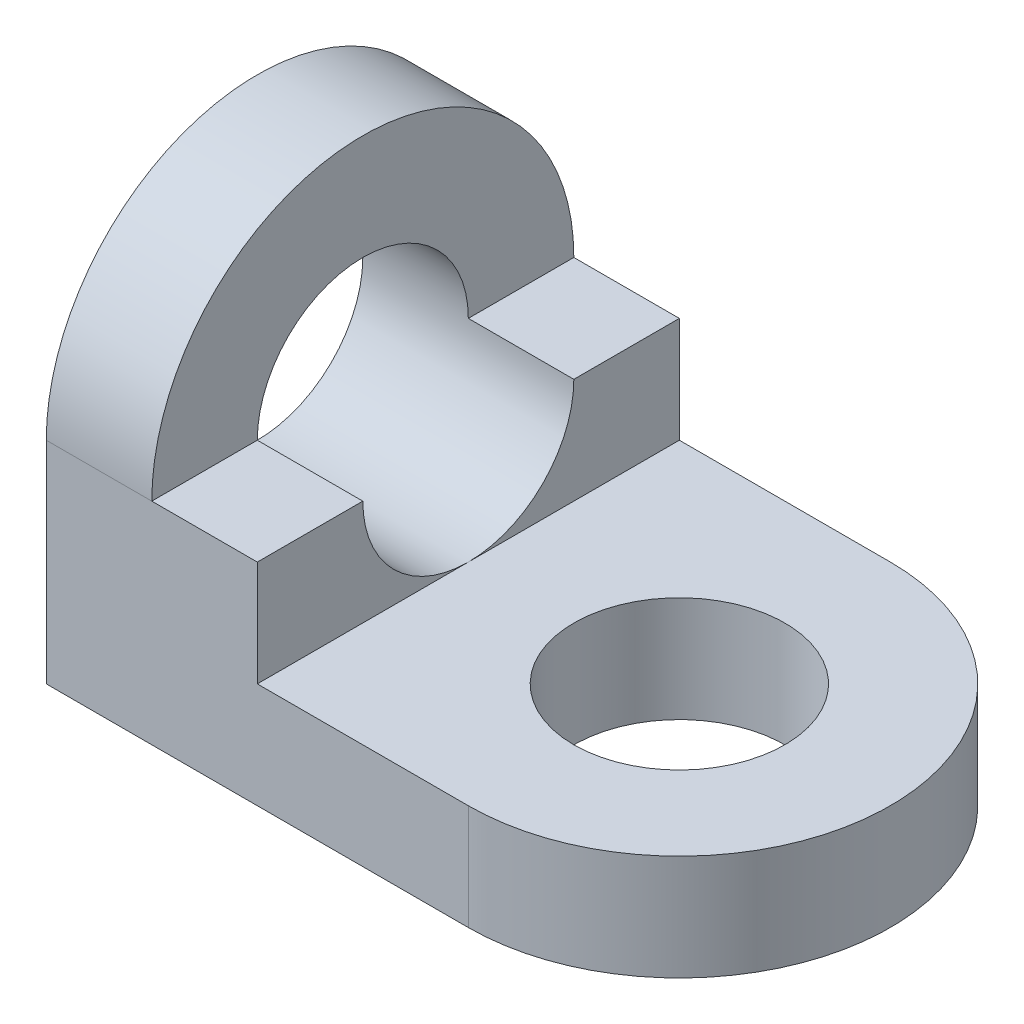
ISO-10303-21;
HEADER;
FILE_DESCRIPTION(('STEP AP214'),'2;1');
FILE_NAME('part.step','',(''),(''),'','','');
FILE_SCHEMA(('AUTOMOTIVE_DESIGN { 1 0 10303 214 1 1 1 1 }'));
ENDSEC;
DATA;
#1=APPLICATION_CONTEXT('core data for automotive mechanical design processes');
#2=APPLICATION_PROTOCOL_DEFINITION('international standard','automotive_design',2000,#1);
#3=PRODUCT_CONTEXT('',#1,'mechanical');
#4=PRODUCT('Part','Part','',(#3));
#5=PRODUCT_RELATED_PRODUCT_CATEGORY('part','',(#4));
#6=PRODUCT_DEFINITION_FORMATION('','',#4);
#7=PRODUCT_DEFINITION_CONTEXT('part definition',#1,'design');
#8=PRODUCT_DEFINITION('design','',#6,#7);
#9=PRODUCT_DEFINITION_SHAPE('','',#8);
#10=(LENGTH_UNIT() NAMED_UNIT(*) SI_UNIT(.MILLI.,.METRE.));
#11=(NAMED_UNIT(*) PLANE_ANGLE_UNIT() SI_UNIT($,.RADIAN.));
#12=(NAMED_UNIT(*) SI_UNIT($,.STERADIAN.) SOLID_ANGLE_UNIT());
#13=UNCERTAINTY_MEASURE_WITH_UNIT(LENGTH_MEASURE(1.E-05),#10,'distance_accuracy_value','');
#14=(GEOMETRIC_REPRESENTATION_CONTEXT(3) GLOBAL_UNCERTAINTY_ASSIGNED_CONTEXT((#13)) GLOBAL_UNIT_ASSIGNED_CONTEXT((#10,
#11,#12)) REPRESENTATION_CONTEXT('',''));
#15=CARTESIAN_POINT('',(0.,0.,0.));
#16=DIRECTION('',(0.,0.,1.));
#17=DIRECTION('',(1.,0.,0.));
#18=AXIS2_PLACEMENT_3D('',#15,#16,#17);
#19=CARTESIAN_POINT('',(5.,0.,0.));
#20=DIRECTION('',(1.,0.,0.));
#21=DIRECTION('',(0.,0.,-1.));
#22=AXIS2_PLACEMENT_3D('',#19,#20,#21);
#23=PLANE('',#22);
#24=DIRECTION('',(0.,0.,1.));
#25=VECTOR('',#24,1.);
#26=CARTESIAN_POINT('',(5.,10.,0.));
#27=LINE('',#26,#25);
#28=CARTESIAN_POINT('',(5.,10.,-10.));
#29=VERTEX_POINT('',#28);
#30=CARTESIAN_POINT('',(5.,10.,-5.));
#31=VERTEX_POINT('',#30);
#32=EDGE_CURVE('E202',#29,#31,#27,.T.);
#33=ORIENTED_EDGE('',*,*,#32,.F.);
#34=CARTESIAN_POINT('',(5.,10.,0.));
#35=DIRECTION('',(1.,0.,0.));
#36=DIRECTION('',(0.,0.,-1.));
#37=AXIS2_PLACEMENT_3D('',#34,#35,#36);
#38=CIRCLE('',#37,10.);
#39=CARTESIAN_POINT('',(5.,10.,10.));
#40=VERTEX_POINT('',#39);
#41=EDGE_CURVE('E213',#29,#40,#38,.T.);
#42=ORIENTED_EDGE('',*,*,#41,.T.);
#43=DIRECTION('',(0.,0.,-1.));
#44=VECTOR('',#43,1.);
#45=CARTESIAN_POINT('',(5.,10.,0.));
#46=LINE('',#45,#44);
#47=CARTESIAN_POINT('',(5.,10.,5.));
#48=VERTEX_POINT('',#47);
#49=EDGE_CURVE('E177',#40,#48,#46,.T.);
#50=ORIENTED_EDGE('',*,*,#49,.T.);
#51=CARTESIAN_POINT('',(5.,10.,0.));
#52=DIRECTION('',(1.,0.,0.));
#53=DIRECTION('',(0.,0.,-1.));
#54=AXIS2_PLACEMENT_3D('',#51,#52,#53);
#55=CIRCLE('',#54,5.);
#56=EDGE_CURVE('E206',#31,#48,#55,.T.);
#57=ORIENTED_EDGE('',*,*,#56,.F.);
#58=EDGE_LOOP('',(#33,#42,#50,#57));
#59=FACE_BOUND('',#58,.T.);
#60=ADVANCED_FACE('F89',(#59),#23,.T.);
#61=CARTESIAN_POINT('',(20.,5.,0.));
#62=DIRECTION('',(0.,1.,0.));
#63=DIRECTION('',(0.,0.,1.));
#64=AXIS2_PLACEMENT_3D('',#61,#62,#63);
#65=PLANE('',#64);
#66=DIRECTION('',(0.,0.,-1.));
#67=VECTOR('',#66,1.);
#68=CARTESIAN_POINT('',(10.,5.,0.));
#69=LINE('',#68,#67);
#70=CARTESIAN_POINT('',(10.,5.,10.));
#71=VERTEX_POINT('',#70);
#72=CARTESIAN_POINT('',(10.,5.,0.));
#73=VERTEX_POINT('',#72);
#74=EDGE_CURVE('E205',#71,#73,#69,.T.);
#75=ORIENTED_EDGE('',*,*,#74,.F.);
#76=DIRECTION('',(1.,0.,0.));
#77=VECTOR('',#76,1.);
#78=CARTESIAN_POINT('',(0.,5.,10.));
#79=LINE('',#78,#77);
#80=CARTESIAN_POINT('',(20.,5.,10.));
#81=VERTEX_POINT('',#80);
#82=EDGE_CURVE('E232',#71,#81,#79,.T.);
#83=ORIENTED_EDGE('',*,*,#82,.T.);
#84=CARTESIAN_POINT('',(20.,5.,0.));
#85=DIRECTION('',(0.,1.,0.));
#86=DIRECTION('',(0.,0.,1.));
#87=AXIS2_PLACEMENT_3D('',#84,#85,#86);
#88=CIRCLE('',#87,10.);
#89=CARTESIAN_POINT('',(20.,5.,-10.));
#90=VERTEX_POINT('',#89);
#91=EDGE_CURVE('E228',#81,#90,#88,.T.);
#92=ORIENTED_EDGE('',*,*,#91,.T.);
#93=DIRECTION('',(-1.,0.,0.));
#94=VECTOR('',#93,1.);
#95=CARTESIAN_POINT('',(20.,5.,-10.));
#96=LINE('',#95,#94);
#97=CARTESIAN_POINT('',(10.,5.,-10.));
#98=VERTEX_POINT('',#97);
#99=EDGE_CURVE('E109',#90,#98,#96,.T.);
#100=ORIENTED_EDGE('',*,*,#99,.T.);
#101=EDGE_CURVE('E104',#73,#98,#69,.T.);
#102=ORIENTED_EDGE('',*,*,#101,.F.);
#103=EDGE_LOOP('',(#75,#83,#92,#100,#102));
#104=FACE_BOUND('',#103,.T.);
#105=CARTESIAN_POINT('',(20.,5.,0.));
#106=DIRECTION('',(0.,1.,0.));
#107=DIRECTION('',(0.,0.,1.));
#108=AXIS2_PLACEMENT_3D('',#105,#106,#107);
#109=CIRCLE('',#108,5.);
#110=CARTESIAN_POINT('',(20.,5.,5.));
#111=VERTEX_POINT('',#110);
#112=EDGE_CURVE('E222',#111,#111,#109,.T.);
#113=ORIENTED_EDGE('',*,*,#112,.F.);
#114=EDGE_LOOP('',(#113));
#115=FACE_BOUND('',#114,.T.);
#116=ADVANCED_FACE('F263',(#104,#115),#65,.T.);
#117=CARTESIAN_POINT('',(20.,0.,0.));
#118=DIRECTION('',(0.,1.,0.));
#119=DIRECTION('',(0.,0.,1.));
#120=AXIS2_PLACEMENT_3D('',#117,#118,#119);
#121=PLANE('',#120);
#122=CARTESIAN_POINT('',(20.,0.,0.));
#123=DIRECTION('',(0.,1.,0.));
#124=DIRECTION('',(0.,0.,1.));
#125=AXIS2_PLACEMENT_3D('',#122,#123,#124);
#126=CIRCLE('',#125,10.);
#127=CARTESIAN_POINT('',(20.,0.,10.));
#128=VERTEX_POINT('',#127);
#129=CARTESIAN_POINT('',(20.,0.,-10.));
#130=VERTEX_POINT('',#129);
#131=EDGE_CURVE('E225',#128,#130,#126,.T.);
#132=ORIENTED_EDGE('',*,*,#131,.F.);
#133=DIRECTION('',(1.,0.,0.));
#134=VECTOR('',#133,1.);
#135=CARTESIAN_POINT('',(0.,0.,10.));
#136=LINE('',#135,#134);
#137=CARTESIAN_POINT('',(0.,0.,10.));
#138=VERTEX_POINT('',#137);
#139=EDGE_CURVE('E230',#138,#128,#136,.T.);
#140=ORIENTED_EDGE('',*,*,#139,.F.);
#141=DIRECTION('',(0.,0.,1.));
#142=VECTOR('',#141,1.);
#143=CARTESIAN_POINT('',(0.,0.,-10.));
#144=LINE('',#143,#142);
#145=CARTESIAN_POINT('',(0.,0.,-10.));
#146=VERTEX_POINT('',#145);
#147=EDGE_CURVE('E239',#146,#138,#144,.T.);
#148=ORIENTED_EDGE('',*,*,#147,.F.);
#149=DIRECTION('',(-1.,0.,0.));
#150=VECTOR('',#149,1.);
#151=CARTESIAN_POINT('',(20.,0.,-10.));
#152=LINE('',#151,#150);
#153=EDGE_CURVE('E237',#130,#146,#152,.T.);
#154=ORIENTED_EDGE('',*,*,#153,.F.);
#155=EDGE_LOOP('',(#132,#140,#148,#154));
#156=FACE_BOUND('',#155,.T.);
#157=CARTESIAN_POINT('',(20.,0.,0.));
#158=DIRECTION('',(0.,1.,0.));
#159=DIRECTION('',(0.,0.,1.));
#160=AXIS2_PLACEMENT_3D('',#157,#158,#159);
#161=CIRCLE('',#160,5.);
#162=CARTESIAN_POINT('',(20.,0.,5.));
#163=VERTEX_POINT('',#162);
#164=EDGE_CURVE('E221',#163,#163,#161,.T.);
#165=ORIENTED_EDGE('',*,*,#164,.T.);
#166=EDGE_LOOP('',(#165));
#167=FACE_BOUND('',#166,.T.);
#168=ADVANCED_FACE('F254',(#156,#167),#121,.F.);
#169=CARTESIAN_POINT('',(20.,5.,0.));
#170=DIRECTION('',(0.,-1.,0.));
#171=DIRECTION('',(0.,0.,-1.));
#172=AXIS2_PLACEMENT_3D('',#169,#170,#171);
#173=CYLINDRICAL_SURFACE('',#172,10.);
#174=ORIENTED_EDGE('',*,*,#131,.T.);
#175=DIRECTION('',(0.,-1.,0.));
#176=VECTOR('',#175,1.);
#177=CARTESIAN_POINT('',(20.,5.,-10.));
#178=LINE('',#177,#176);
#179=EDGE_CURVE('E12',#90,#130,#178,.T.);
#180=ORIENTED_EDGE('',*,*,#179,.F.);
#181=ORIENTED_EDGE('',*,*,#91,.F.);
#182=DIRECTION('',(0.,-1.,0.));
#183=VECTOR('',#182,1.);
#184=CARTESIAN_POINT('',(20.,5.,10.));
#185=LINE('',#184,#183);
#186=EDGE_CURVE('E234',#81,#128,#185,.T.);
#187=ORIENTED_EDGE('',*,*,#186,.T.);
#188=EDGE_LOOP('',(#174,#180,#181,#187));
#189=FACE_BOUND('',#188,.T.);
#190=ADVANCED_FACE('F91',(#189),#173,.T.);
#191=CARTESIAN_POINT('',(20.,5.,-10.));
#192=DIRECTION('',(0.,0.,1.));
#193=DIRECTION('',(1.,0.,0.));
#194=AXIS2_PLACEMENT_3D('',#191,#192,#193);
#195=PLANE('',#194);
#196=DIRECTION('',(0.,1.,0.));
#197=VECTOR('',#196,1.);
#198=CARTESIAN_POINT('',(10.,0.,-10.));
#199=LINE('',#198,#197);
#200=CARTESIAN_POINT('',(10.,10.,-10.));
#201=VERTEX_POINT('',#200);
#202=EDGE_CURVE('E161',#98,#201,#199,.T.);
#203=ORIENTED_EDGE('',*,*,#202,.F.);
#204=ORIENTED_EDGE('',*,*,#99,.F.);
#205=ORIENTED_EDGE('',*,*,#179,.T.);
#206=ORIENTED_EDGE('',*,*,#153,.T.);
#207=DIRECTION('',(0.,-1.,0.));
#208=VECTOR('',#207,1.);
#209=CARTESIAN_POINT('',(0.,5.,-10.));
#210=LINE('',#209,#208);
#211=CARTESIAN_POINT('',(0.,10.,-10.));
#212=VERTEX_POINT('',#211);
#213=EDGE_CURVE('E97',#212,#146,#210,.T.);
#214=ORIENTED_EDGE('',*,*,#213,.F.);
#215=DIRECTION('',(-1.,0.,0.));
#216=VECTOR('',#215,1.);
#217=CARTESIAN_POINT('',(5.,10.,-10.));
#218=LINE('',#217,#216);
#219=EDGE_CURVE('E174',#29,#212,#218,.T.);
#220=ORIENTED_EDGE('',*,*,#219,.F.);
#221=DIRECTION('',(-1.,0.,0.));
#222=VECTOR('',#221,1.);
#223=CARTESIAN_POINT('',(10.,10.,-10.));
#224=LINE('',#223,#222);
#225=EDGE_CURVE('E171',#201,#29,#224,.T.);
#226=ORIENTED_EDGE('',*,*,#225,.F.);
#227=EDGE_LOOP('',(#203,#204,#205,#206,#214,#220,#226));
#228=FACE_BOUND('',#227,.T.);
#229=ADVANCED_FACE('F172',(#228),#195,.F.);
#230=CARTESIAN_POINT('',(0.,5.,-10.));
#231=DIRECTION('',(1.,0.,0.));
#232=DIRECTION('',(0.,0.,-1.));
#233=AXIS2_PLACEMENT_3D('',#230,#231,#232);
#234=PLANE('',#233);
#235=CARTESIAN_POINT('',(0.,10.,0.));
#236=DIRECTION('',(1.,0.,0.));
#237=DIRECTION('',(0.,0.,-1.));
#238=AXIS2_PLACEMENT_3D('',#235,#236,#237);
#239=CIRCLE('',#238,5.);
#240=CARTESIAN_POINT('',(0.,10.,-5.));
#241=VERTEX_POINT('',#240);
#242=EDGE_CURVE('E210',#241,#241,#239,.T.);
#243=ORIENTED_EDGE('',*,*,#242,.T.);
#244=EDGE_LOOP('',(#243));
#245=FACE_BOUND('',#244,.T.);
#246=CARTESIAN_POINT('',(0.,10.,0.));
#247=DIRECTION('',(1.,0.,0.));
#248=DIRECTION('',(0.,0.,-1.));
#249=AXIS2_PLACEMENT_3D('',#246,#247,#248);
#250=CIRCLE('',#249,10.);
#251=CARTESIAN_POINT('',(0.,10.,10.));
#252=VERTEX_POINT('',#251);
#253=EDGE_CURVE('E209',#212,#252,#250,.T.);
#254=ORIENTED_EDGE('',*,*,#253,.F.);
#255=ORIENTED_EDGE('',*,*,#213,.T.);
#256=ORIENTED_EDGE('',*,*,#147,.T.);
#257=DIRECTION('',(0.,-1.,0.));
#258=VECTOR('',#257,1.);
#259=CARTESIAN_POINT('',(0.,5.,10.));
#260=LINE('',#259,#258);
#261=EDGE_CURVE('E244',#252,#138,#260,.T.);
#262=ORIENTED_EDGE('',*,*,#261,.F.);
#263=EDGE_LOOP('',(#254,#255,#256,#262));
#264=FACE_BOUND('',#263,.T.);
#265=ADVANCED_FACE('F250',(#245,#264),#234,.F.);
#266=CARTESIAN_POINT('',(0.,5.,10.));
#267=DIRECTION('',(0.,0.,-1.));
#268=DIRECTION('',(-1.,0.,0.));
#269=AXIS2_PLACEMENT_3D('',#266,#267,#268);
#270=PLANE('',#269);
#271=ORIENTED_EDGE('',*,*,#82,.F.);
#272=DIRECTION('',(0.,-1.,0.));
#273=VECTOR('',#272,1.);
#274=CARTESIAN_POINT('',(10.,0.,10.));
#275=LINE('',#274,#273);
#276=CARTESIAN_POINT('',(10.,10.,10.));
#277=VERTEX_POINT('',#276);
#278=EDGE_CURVE('E191',#277,#71,#275,.T.);
#279=ORIENTED_EDGE('',*,*,#278,.F.);
#280=DIRECTION('',(-1.,0.,0.));
#281=VECTOR('',#280,1.);
#282=CARTESIAN_POINT('',(10.,10.,10.));
#283=LINE('',#282,#281);
#284=EDGE_CURVE('E194',#277,#40,#283,.T.);
#285=ORIENTED_EDGE('',*,*,#284,.T.);
#286=DIRECTION('',(-1.,0.,0.));
#287=VECTOR('',#286,1.);
#288=CARTESIAN_POINT('',(5.,10.,10.));
#289=LINE('',#288,#287);
#290=EDGE_CURVE('E215',#40,#252,#289,.T.);
#291=ORIENTED_EDGE('',*,*,#290,.T.);
#292=ORIENTED_EDGE('',*,*,#261,.T.);
#293=ORIENTED_EDGE('',*,*,#139,.T.);
#294=ORIENTED_EDGE('',*,*,#186,.F.);
#295=EDGE_LOOP('',(#271,#279,#285,#291,#292,#293,#294));
#296=FACE_BOUND('',#295,.T.);
#297=ADVANCED_FACE('F259',(#296),#270,.F.);
#298=CARTESIAN_POINT('',(20.,5.,0.));
#299=DIRECTION('',(0.,-1.,0.));
#300=DIRECTION('',(0.,0.,-1.));
#301=AXIS2_PLACEMENT_3D('',#298,#299,#300);
#302=CYLINDRICAL_SURFACE('',#301,5.);
#303=ORIENTED_EDGE('',*,*,#112,.T.);
#304=EDGE_LOOP('',(#303));
#305=FACE_BOUND('',#304,.T.);
#306=ORIENTED_EDGE('',*,*,#164,.F.);
#307=EDGE_LOOP('',(#306));
#308=FACE_BOUND('',#307,.T.);
#309=ADVANCED_FACE('F292',(#305,#308),#302,.F.);
#310=CARTESIAN_POINT('',(5.,10.,0.));
#311=DIRECTION('',(-1.,0.,0.));
#312=DIRECTION('',(0.,0.,1.));
#313=AXIS2_PLACEMENT_3D('',#310,#311,#312);
#314=CYLINDRICAL_SURFACE('',#313,10.);
#315=ORIENTED_EDGE('',*,*,#253,.T.);
#316=ORIENTED_EDGE('',*,*,#290,.F.);
#317=ORIENTED_EDGE('',*,*,#41,.F.);
#318=ORIENTED_EDGE('',*,*,#219,.T.);
#319=EDGE_LOOP('',(#315,#316,#317,#318));
#320=FACE_BOUND('',#319,.T.);
#321=ADVANCED_FACE('F277',(#320),#314,.T.);
#322=CARTESIAN_POINT('',(5.,10.,0.));
#323=DIRECTION('',(-1.,0.,0.));
#324=DIRECTION('',(0.,0.,1.));
#325=AXIS2_PLACEMENT_3D('',#322,#323,#324);
#326=CYLINDRICAL_SURFACE('',#325,5.);
#327=CARTESIAN_POINT('',(10.,10.,0.));
#328=DIRECTION('',(1.,0.,0.));
#329=DIRECTION('',(0.,0.,-1.));
#330=AXIS2_PLACEMENT_3D('',#327,#328,#329);
#331=CIRCLE('',#330,5.);
#332=CARTESIAN_POINT('',(10.,10.,5.));
#333=VERTEX_POINT('',#332);
#334=EDGE_CURVE('E185',#333,#73,#331,.T.);
#335=ORIENTED_EDGE('',*,*,#334,.T.);
#336=CARTESIAN_POINT('',(10.,10.,-5.));
#337=VERTEX_POINT('',#336);
#338=EDGE_CURVE('E183',#73,#337,#331,.T.);
#339=ORIENTED_EDGE('',*,*,#338,.T.);
#340=DIRECTION('',(-1.,0.,0.));
#341=VECTOR('',#340,1.);
#342=CARTESIAN_POINT('',(10.,10.,-5.));
#343=LINE('',#342,#341);
#344=EDGE_CURVE('E178',#337,#31,#343,.T.);
#345=ORIENTED_EDGE('',*,*,#344,.T.);
#346=ORIENTED_EDGE('',*,*,#56,.T.);
#347=DIRECTION('',(-1.,0.,0.));
#348=VECTOR('',#347,1.);
#349=CARTESIAN_POINT('',(10.,10.,5.));
#350=LINE('',#349,#348);
#351=EDGE_CURVE('E197',#333,#48,#350,.T.);
#352=ORIENTED_EDGE('',*,*,#351,.F.);
#353=EDGE_LOOP('',(#335,#339,#345,#346,#352));
#354=FACE_BOUND('',#353,.T.);
#355=ORIENTED_EDGE('',*,*,#242,.F.);
#356=EDGE_LOOP('',(#355));
#357=FACE_BOUND('',#356,.T.);
#358=ADVANCED_FACE('F280',(#354,#357),#326,.F.);
#359=CARTESIAN_POINT('',(10.,0.,0.));
#360=DIRECTION('',(1.,0.,0.));
#361=DIRECTION('',(0.,0.,-1.));
#362=AXIS2_PLACEMENT_3D('',#359,#360,#361);
#363=PLANE('',#362);
#364=ORIENTED_EDGE('',*,*,#278,.T.);
#365=ORIENTED_EDGE('',*,*,#74,.T.);
#366=ORIENTED_EDGE('',*,*,#334,.F.);
#367=DIRECTION('',(0.,0.,1.));
#368=VECTOR('',#367,1.);
#369=CARTESIAN_POINT('',(10.,10.,0.));
#370=LINE('',#369,#368);
#371=EDGE_CURVE('E189',#333,#277,#370,.T.);
#372=ORIENTED_EDGE('',*,*,#371,.T.);
#373=EDGE_LOOP('',(#364,#365,#366,#372));
#374=FACE_BOUND('',#373,.T.);
#375=ADVANCED_FACE('F267',(#374),#363,.T.);
#376=CARTESIAN_POINT('',(10.,10.,0.));
#377=DIRECTION('',(0.,1.,0.));
#378=DIRECTION('',(0.,0.,1.));
#379=AXIS2_PLACEMENT_3D('',#376,#377,#378);
#380=PLANE('',#379);
#381=ORIENTED_EDGE('',*,*,#225,.T.);
#382=ORIENTED_EDGE('',*,*,#32,.T.);
#383=ORIENTED_EDGE('',*,*,#344,.F.);
#384=DIRECTION('',(0.,0.,-1.));
#385=VECTOR('',#384,1.);
#386=CARTESIAN_POINT('',(10.,10.,0.));
#387=LINE('',#386,#385);
#388=EDGE_CURVE('E166',#337,#201,#387,.T.);
#389=ORIENTED_EDGE('',*,*,#388,.T.);
#390=EDGE_LOOP('',(#381,#382,#383,#389));
#391=FACE_BOUND('',#390,.T.);
#392=ADVANCED_FACE('F181',(#391),#380,.T.);
#393=CARTESIAN_POINT('',(10.,10.,0.));
#394=DIRECTION('',(0.,-1.,0.));
#395=DIRECTION('',(0.,0.,-1.));
#396=AXIS2_PLACEMENT_3D('',#393,#394,#395);
#397=PLANE('',#396);
#398=ORIENTED_EDGE('',*,*,#49,.F.);
#399=ORIENTED_EDGE('',*,*,#284,.F.);
#400=ORIENTED_EDGE('',*,*,#371,.F.);
#401=ORIENTED_EDGE('',*,*,#351,.T.);
#402=EDGE_LOOP('',(#398,#399,#400,#401));
#403=FACE_BOUND('',#402,.T.);
#404=ADVANCED_FACE('F273',(#403),#397,.F.);
#405=ORIENTED_EDGE('',*,*,#338,.F.);
#406=ORIENTED_EDGE('',*,*,#101,.T.);
#407=ORIENTED_EDGE('',*,*,#202,.T.);
#408=ORIENTED_EDGE('',*,*,#388,.F.);
#409=EDGE_LOOP('',(#405,#406,#407,#408));
#410=FACE_BOUND('',#409,.T.);
#411=ADVANCED_FACE('F164',(#410),#363,.T.);
#412=CLOSED_SHELL('',(#60,#116,#168,#190,#229,#265,#297,#309,#321,#358,#375,#392,#404,#411));
#413=MANIFOLD_SOLID_BREP('B2',#412);
#414=ADVANCED_BREP_SHAPE_REPRESENTATION('',(#18,#413),#14);
#415=SHAPE_DEFINITION_REPRESENTATION(#9,#414);
ENDSEC;
END-ISO-10303-21;
